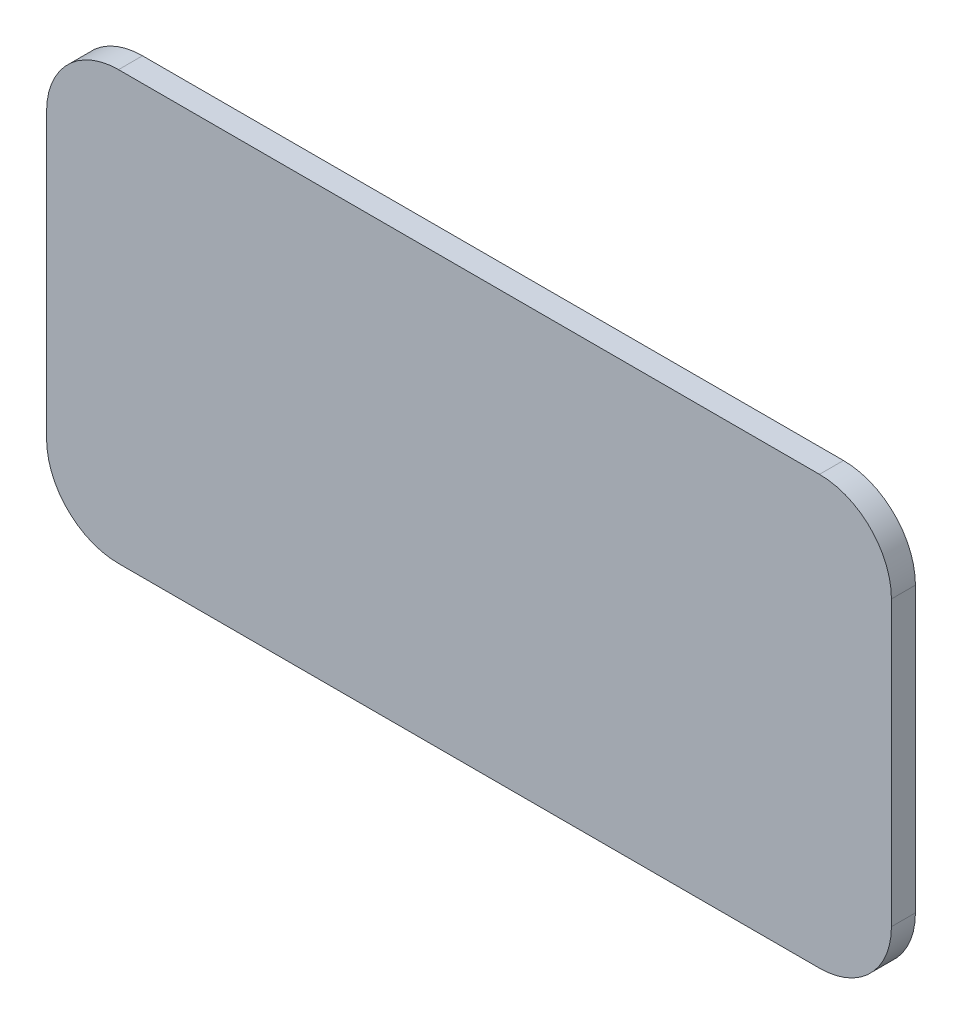
ISO-10303-21;
HEADER;
FILE_DESCRIPTION(('STEP AP214'),'2;1');
FILE_NAME('part.step','',(''),(''),'','','');
FILE_SCHEMA(('AUTOMOTIVE_DESIGN { 1 0 10303 214 1 1 1 1 }'));
ENDSEC;
DATA;
#1=APPLICATION_CONTEXT('core data for automotive mechanical design processes');
#2=APPLICATION_PROTOCOL_DEFINITION('international standard','automotive_design',2000,#1);
#3=PRODUCT_CONTEXT('',#1,'mechanical');
#4=PRODUCT('Part','Part','',(#3));
#5=PRODUCT_RELATED_PRODUCT_CATEGORY('part','',(#4));
#6=PRODUCT_DEFINITION_FORMATION('','',#4);
#7=PRODUCT_DEFINITION_CONTEXT('part definition',#1,'design');
#8=PRODUCT_DEFINITION('design','',#6,#7);
#9=PRODUCT_DEFINITION_SHAPE('','',#8);
#10=(LENGTH_UNIT() NAMED_UNIT(*) SI_UNIT(.MILLI.,.METRE.));
#11=(NAMED_UNIT(*) PLANE_ANGLE_UNIT() SI_UNIT($,.RADIAN.));
#12=(NAMED_UNIT(*) SI_UNIT($,.STERADIAN.) SOLID_ANGLE_UNIT());
#13=UNCERTAINTY_MEASURE_WITH_UNIT(LENGTH_MEASURE(1.E-05),#10,'distance_accuracy_value','');
#14=(GEOMETRIC_REPRESENTATION_CONTEXT(3) GLOBAL_UNCERTAINTY_ASSIGNED_CONTEXT((#13)) GLOBAL_UNIT_ASSIGNED_CONTEXT((#10,
#11,#12)) REPRESENTATION_CONTEXT('',''));
#15=CARTESIAN_POINT('',(0.,0.,0.));
#16=DIRECTION('',(0.,0.,1.));
#17=DIRECTION('',(1.,0.,0.));
#18=AXIS2_PLACEMENT_3D('',#15,#16,#17);
#19=CARTESIAN_POINT('',(-238.35,7.00000000000002,6.));
#20=DIRECTION('',(0.,0.,-1.));
#21=DIRECTION('',(-1.,0.,0.));
#22=AXIS2_PLACEMENT_3D('',#19,#20,#21);
#23=CYLINDRICAL_SURFACE('',#22,18.);
#24=CARTESIAN_POINT('',(-238.35,7.00000000000002,0.));
#25=DIRECTION('',(0.,0.,1.));
#26=DIRECTION('',(1.,0.,0.));
#27=AXIS2_PLACEMENT_3D('',#24,#25,#26);
#28=CIRCLE('',#27,18.);
#29=CARTESIAN_POINT('',(-256.35,7.00000000000002,0.));
#30=VERTEX_POINT('',#29);
#31=CARTESIAN_POINT('',(-238.35,-11.,0.));
#32=VERTEX_POINT('',#31);
#33=EDGE_CURVE('E144',#30,#32,#28,.T.);
#34=ORIENTED_EDGE('',*,*,#33,.T.);
#35=DIRECTION('',(0.,0.,-1.));
#36=VECTOR('',#35,1.);
#37=CARTESIAN_POINT('',(-238.35,-11.,6.));
#38=LINE('',#37,#36);
#39=CARTESIAN_POINT('',(-238.35,-11.,6.));
#40=VERTEX_POINT('',#39);
#41=EDGE_CURVE('E11',#40,#32,#38,.T.);
#42=ORIENTED_EDGE('',*,*,#41,.F.);
#43=CARTESIAN_POINT('',(-238.35,7.00000000000002,6.));
#44=DIRECTION('',(0.,0.,1.));
#45=DIRECTION('',(1.,0.,0.));
#46=AXIS2_PLACEMENT_3D('',#43,#44,#45);
#47=CIRCLE('',#46,18.);
#48=CARTESIAN_POINT('',(-256.35,7.00000000000002,6.));
#49=VERTEX_POINT('',#48);
#50=EDGE_CURVE('E162',#49,#40,#47,.T.);
#51=ORIENTED_EDGE('',*,*,#50,.F.);
#52=DIRECTION('',(0.,0.,-1.));
#53=VECTOR('',#52,1.);
#54=CARTESIAN_POINT('',(-256.35,7.00000000000002,6.));
#55=LINE('',#54,#53);
#56=EDGE_CURVE('E140',#49,#30,#55,.T.);
#57=ORIENTED_EDGE('',*,*,#56,.T.);
#58=EDGE_LOOP('',(#34,#42,#51,#57));
#59=FACE_BOUND('',#58,.T.);
#60=ADVANCED_FACE('F41',(#59),#23,.T.);
#61=CARTESIAN_POINT('',(-238.35,-11.,6.));
#62=DIRECTION('',(0.,1.,0.));
#63=DIRECTION('',(-1.,0.,0.));
#64=AXIS2_PLACEMENT_3D('',#61,#62,#63);
#65=PLANE('',#64);
#66=DIRECTION('',(1.,0.,0.));
#67=VECTOR('',#66,1.);
#68=CARTESIAN_POINT('',(-238.35,-11.,0.));
#69=LINE('',#68,#67);
#70=CARTESIAN_POINT('',(-62.991811866727,-11.,0.));
#71=VERTEX_POINT('',#70);
#72=EDGE_CURVE('E148',#32,#71,#69,.T.);
#73=ORIENTED_EDGE('',*,*,#72,.T.);
#74=DIRECTION('',(0.,0.,-1.));
#75=VECTOR('',#74,1.);
#76=CARTESIAN_POINT('',(-62.991811866727,-11.,6.));
#77=LINE('',#76,#75);
#78=CARTESIAN_POINT('',(-62.991811866727,-11.,6.));
#79=VERTEX_POINT('',#78);
#80=EDGE_CURVE('E50',#79,#71,#77,.T.);
#81=ORIENTED_EDGE('',*,*,#80,.F.);
#82=DIRECTION('',(1.,0.,0.));
#83=VECTOR('',#82,1.);
#84=CARTESIAN_POINT('',(-238.35,-11.,6.));
#85=LINE('',#84,#83);
#86=EDGE_CURVE('E105',#40,#79,#85,.T.);
#87=ORIENTED_EDGE('',*,*,#86,.F.);
#88=ORIENTED_EDGE('',*,*,#41,.T.);
#89=EDGE_LOOP('',(#73,#81,#87,#88));
#90=FACE_BOUND('',#89,.T.);
#91=ADVANCED_FACE('F200',(#90),#65,.F.);
#92=CARTESIAN_POINT('',(-62.991811866727,7.,6.));
#93=DIRECTION('',(0.,0.,-1.));
#94=DIRECTION('',(-1.,0.,0.));
#95=AXIS2_PLACEMENT_3D('',#92,#93,#94);
#96=CYLINDRICAL_SURFACE('',#95,18.);
#97=CARTESIAN_POINT('',(-62.991811866727,7.,0.));
#98=DIRECTION('',(0.,0.,1.));
#99=DIRECTION('',(1.,0.,0.));
#100=AXIS2_PLACEMENT_3D('',#97,#98,#99);
#101=CIRCLE('',#100,18.);
#102=CARTESIAN_POINT('',(-44.991811866727,7.,0.));
#103=VERTEX_POINT('',#102);
#104=EDGE_CURVE('E151',#71,#103,#101,.T.);
#105=ORIENTED_EDGE('',*,*,#104,.T.);
#106=DIRECTION('',(0.,0.,-1.));
#107=VECTOR('',#106,1.);
#108=CARTESIAN_POINT('',(-44.991811866727,7.,6.));
#109=LINE('',#108,#107);
#110=CARTESIAN_POINT('',(-44.991811866727,7.,6.));
#111=VERTEX_POINT('',#110);
#112=EDGE_CURVE('E170',#111,#103,#109,.T.);
#113=ORIENTED_EDGE('',*,*,#112,.F.);
#114=CARTESIAN_POINT('',(-62.991811866727,7.,6.));
#115=DIRECTION('',(0.,0.,1.));
#116=DIRECTION('',(1.,0.,0.));
#117=AXIS2_PLACEMENT_3D('',#114,#115,#116);
#118=CIRCLE('',#117,18.);
#119=EDGE_CURVE('E178',#79,#111,#118,.T.);
#120=ORIENTED_EDGE('',*,*,#119,.F.);
#121=ORIENTED_EDGE('',*,*,#80,.T.);
#122=EDGE_LOOP('',(#105,#113,#120,#121));
#123=FACE_BOUND('',#122,.T.);
#124=ADVANCED_FACE('F176',(#123),#96,.T.);
#125=CARTESIAN_POINT('',(-44.991811866727,7.,6.));
#126=DIRECTION('',(-1.,0.,0.));
#127=DIRECTION('',(0.,-1.,0.));
#128=AXIS2_PLACEMENT_3D('',#125,#126,#127);
#129=PLANE('',#128);
#130=DIRECTION('',(0.,1.,0.));
#131=VECTOR('',#130,1.);
#132=CARTESIAN_POINT('',(-44.991811866727,7.,0.));
#133=LINE('',#132,#131);
#134=CARTESIAN_POINT('',(-44.991811866727,77.9999999999999,0.));
#135=VERTEX_POINT('',#134);
#136=EDGE_CURVE('E153',#103,#135,#133,.T.);
#137=ORIENTED_EDGE('',*,*,#136,.T.);
#138=DIRECTION('',(0.,0.,-1.));
#139=VECTOR('',#138,1.);
#140=CARTESIAN_POINT('',(-44.991811866727,77.9999999999999,6.));
#141=LINE('',#140,#139);
#142=CARTESIAN_POINT('',(-44.991811866727,77.9999999999999,6.));
#143=VERTEX_POINT('',#142);
#144=EDGE_CURVE('E167',#143,#135,#141,.T.);
#145=ORIENTED_EDGE('',*,*,#144,.F.);
#146=DIRECTION('',(0.,1.,0.));
#147=VECTOR('',#146,1.);
#148=CARTESIAN_POINT('',(-44.991811866727,7.,6.));
#149=LINE('',#148,#147);
#150=EDGE_CURVE('E190',#111,#143,#149,.T.);
#151=ORIENTED_EDGE('',*,*,#150,.F.);
#152=ORIENTED_EDGE('',*,*,#112,.T.);
#153=EDGE_LOOP('',(#137,#145,#151,#152));
#154=FACE_BOUND('',#153,.T.);
#155=ADVANCED_FACE('F186',(#154),#129,.F.);
#156=CARTESIAN_POINT('',(-62.991811866727,78.,6.));
#157=DIRECTION('',(0.,0.,-1.));
#158=DIRECTION('',(-1.,0.,0.));
#159=AXIS2_PLACEMENT_3D('',#156,#157,#158);
#160=CYLINDRICAL_SURFACE('',#159,18.);
#161=CARTESIAN_POINT('',(-62.991811866727,78.,0.));
#162=DIRECTION('',(0.,0.,1.));
#163=DIRECTION('',(1.,0.,0.));
#164=AXIS2_PLACEMENT_3D('',#161,#162,#163);
#165=CIRCLE('',#164,18.);
#166=CARTESIAN_POINT('',(-62.9918118667271,96.,0.));
#167=VERTEX_POINT('',#166);
#168=EDGE_CURVE('E155',#135,#167,#165,.T.);
#169=ORIENTED_EDGE('',*,*,#168,.T.);
#170=DIRECTION('',(0.,0.,-1.));
#171=VECTOR('',#170,1.);
#172=CARTESIAN_POINT('',(-62.9918118667271,96.,6.));
#173=LINE('',#172,#171);
#174=CARTESIAN_POINT('',(-62.9918118667271,96.,6.));
#175=VERTEX_POINT('',#174);
#176=EDGE_CURVE('E134',#175,#167,#173,.T.);
#177=ORIENTED_EDGE('',*,*,#176,.F.);
#178=CARTESIAN_POINT('',(-62.991811866727,78.,6.));
#179=DIRECTION('',(0.,0.,1.));
#180=DIRECTION('',(1.,0.,0.));
#181=AXIS2_PLACEMENT_3D('',#178,#179,#180);
#182=CIRCLE('',#181,18.);
#183=EDGE_CURVE('E124',#143,#175,#182,.T.);
#184=ORIENTED_EDGE('',*,*,#183,.F.);
#185=ORIENTED_EDGE('',*,*,#144,.T.);
#186=EDGE_LOOP('',(#169,#177,#184,#185));
#187=FACE_BOUND('',#186,.T.);
#188=ADVANCED_FACE('F189',(#187),#160,.T.);
#189=CARTESIAN_POINT('',(-62.9918118667271,96.,6.));
#190=DIRECTION('',(0.,-1.,0.));
#191=DIRECTION('',(1.,0.,0.));
#192=AXIS2_PLACEMENT_3D('',#189,#190,#191);
#193=PLANE('',#192);
#194=DIRECTION('',(-1.,0.,0.));
#195=VECTOR('',#194,1.);
#196=CARTESIAN_POINT('',(-62.9918118667271,96.,0.));
#197=LINE('',#196,#195);
#198=CARTESIAN_POINT('',(-238.35,96.,0.));
#199=VERTEX_POINT('',#198);
#200=EDGE_CURVE('E133',#167,#199,#197,.T.);
#201=ORIENTED_EDGE('',*,*,#200,.T.);
#202=DIRECTION('',(0.,0.,-1.));
#203=VECTOR('',#202,1.);
#204=CARTESIAN_POINT('',(-238.35,96.,6.));
#205=LINE('',#204,#203);
#206=CARTESIAN_POINT('',(-238.35,96.,6.));
#207=VERTEX_POINT('',#206);
#208=EDGE_CURVE('E130',#207,#199,#205,.T.);
#209=ORIENTED_EDGE('',*,*,#208,.F.);
#210=DIRECTION('',(-1.,0.,0.));
#211=VECTOR('',#210,1.);
#212=CARTESIAN_POINT('',(-62.9918118667271,96.,6.));
#213=LINE('',#212,#211);
#214=EDGE_CURVE('E118',#175,#207,#213,.T.);
#215=ORIENTED_EDGE('',*,*,#214,.F.);
#216=ORIENTED_EDGE('',*,*,#176,.T.);
#217=EDGE_LOOP('',(#201,#209,#215,#216));
#218=FACE_BOUND('',#217,.T.);
#219=ADVANCED_FACE('F131',(#218),#193,.F.);
#220=CARTESIAN_POINT('',(-238.35,78.,6.));
#221=DIRECTION('',(0.,0.,-1.));
#222=DIRECTION('',(-1.,0.,0.));
#223=AXIS2_PLACEMENT_3D('',#220,#221,#222);
#224=CYLINDRICAL_SURFACE('',#223,18.);
#225=CARTESIAN_POINT('',(-238.35,78.,0.));
#226=DIRECTION('',(0.,0.,1.));
#227=DIRECTION('',(1.,0.,0.));
#228=AXIS2_PLACEMENT_3D('',#225,#226,#227);
#229=CIRCLE('',#228,18.);
#230=CARTESIAN_POINT('',(-256.35,77.9999999999999,0.));
#231=VERTEX_POINT('',#230);
#232=EDGE_CURVE('E90',#199,#231,#229,.T.);
#233=ORIENTED_EDGE('',*,*,#232,.T.);
#234=DIRECTION('',(0.,0.,-1.));
#235=VECTOR('',#234,1.);
#236=CARTESIAN_POINT('',(-256.35,77.9999999999999,6.));
#237=LINE('',#236,#235);
#238=CARTESIAN_POINT('',(-256.35,77.9999999999999,6.));
#239=VERTEX_POINT('',#238);
#240=EDGE_CURVE('E135',#239,#231,#237,.T.);
#241=ORIENTED_EDGE('',*,*,#240,.F.);
#242=CARTESIAN_POINT('',(-238.35,78.,6.));
#243=DIRECTION('',(0.,0.,1.));
#244=DIRECTION('',(1.,0.,0.));
#245=AXIS2_PLACEMENT_3D('',#242,#243,#244);
#246=CIRCLE('',#245,18.);
#247=EDGE_CURVE('E122',#207,#239,#246,.T.);
#248=ORIENTED_EDGE('',*,*,#247,.F.);
#249=ORIENTED_EDGE('',*,*,#208,.T.);
#250=EDGE_LOOP('',(#233,#241,#248,#249));
#251=FACE_BOUND('',#250,.T.);
#252=ADVANCED_FACE('F137',(#251),#224,.T.);
#253=CARTESIAN_POINT('',(-256.35,77.9999999999999,6.));
#254=DIRECTION('',(1.,0.,0.));
#255=DIRECTION('',(0.,1.,0.));
#256=AXIS2_PLACEMENT_3D('',#253,#254,#255);
#257=PLANE('',#256);
#258=DIRECTION('',(0.,-1.,0.));
#259=VECTOR('',#258,1.);
#260=CARTESIAN_POINT('',(-256.35,77.9999999999999,0.));
#261=LINE('',#260,#259);
#262=EDGE_CURVE('E97',#231,#30,#261,.T.);
#263=ORIENTED_EDGE('',*,*,#262,.T.);
#264=ORIENTED_EDGE('',*,*,#56,.F.);
#265=DIRECTION('',(0.,-1.,0.));
#266=VECTOR('',#265,1.);
#267=CARTESIAN_POINT('',(-256.35,77.9999999999999,6.));
#268=LINE('',#267,#266);
#269=EDGE_CURVE('E60',#239,#49,#268,.T.);
#270=ORIENTED_EDGE('',*,*,#269,.F.);
#271=ORIENTED_EDGE('',*,*,#240,.T.);
#272=EDGE_LOOP('',(#263,#264,#270,#271));
#273=FACE_BOUND('',#272,.T.);
#274=ADVANCED_FACE('F216',(#273),#257,.F.);
#275=CARTESIAN_POINT('',(-238.35,7.00000000000002,6.));
#276=DIRECTION('',(0.,0.,1.));
#277=DIRECTION('',(1.,0.,0.));
#278=AXIS2_PLACEMENT_3D('',#275,#276,#277);
#279=PLANE('',#278);
#280=ORIENTED_EDGE('',*,*,#50,.T.);
#281=ORIENTED_EDGE('',*,*,#86,.T.);
#282=ORIENTED_EDGE('',*,*,#119,.T.);
#283=ORIENTED_EDGE('',*,*,#150,.T.);
#284=ORIENTED_EDGE('',*,*,#183,.T.);
#285=ORIENTED_EDGE('',*,*,#214,.T.);
#286=ORIENTED_EDGE('',*,*,#247,.T.);
#287=ORIENTED_EDGE('',*,*,#269,.T.);
#288=EDGE_LOOP('',(#280,#281,#282,#283,#284,#285,#286,#287));
#289=FACE_BOUND('',#288,.T.);
#290=ADVANCED_FACE('F120',(#289),#279,.T.);
#291=CARTESIAN_POINT('',(-238.35,7.00000000000002,0.));
#292=DIRECTION('',(0.,0.,1.));
#293=DIRECTION('',(1.,0.,0.));
#294=AXIS2_PLACEMENT_3D('',#291,#292,#293);
#295=PLANE('',#294);
#296=ORIENTED_EDGE('',*,*,#33,.F.);
#297=ORIENTED_EDGE('',*,*,#262,.F.);
#298=ORIENTED_EDGE('',*,*,#232,.F.);
#299=ORIENTED_EDGE('',*,*,#200,.F.);
#300=ORIENTED_EDGE('',*,*,#168,.F.);
#301=ORIENTED_EDGE('',*,*,#136,.F.);
#302=ORIENTED_EDGE('',*,*,#104,.F.);
#303=ORIENTED_EDGE('',*,*,#72,.F.);
#304=EDGE_LOOP('',(#296,#297,#298,#299,#300,#301,#302,#303));
#305=FACE_BOUND('',#304,.T.);
#306=ADVANCED_FACE('F182',(#305),#295,.F.);
#307=CLOSED_SHELL('',(#60,#91,#124,#155,#188,#219,#252,#274,#290,#306));
#308=MANIFOLD_SOLID_BREP('B2',#307);
#309=ADVANCED_BREP_SHAPE_REPRESENTATION('',(#18,#308),#14);
#310=SHAPE_DEFINITION_REPRESENTATION(#9,#309);
ENDSEC;
END-ISO-10303-21;
